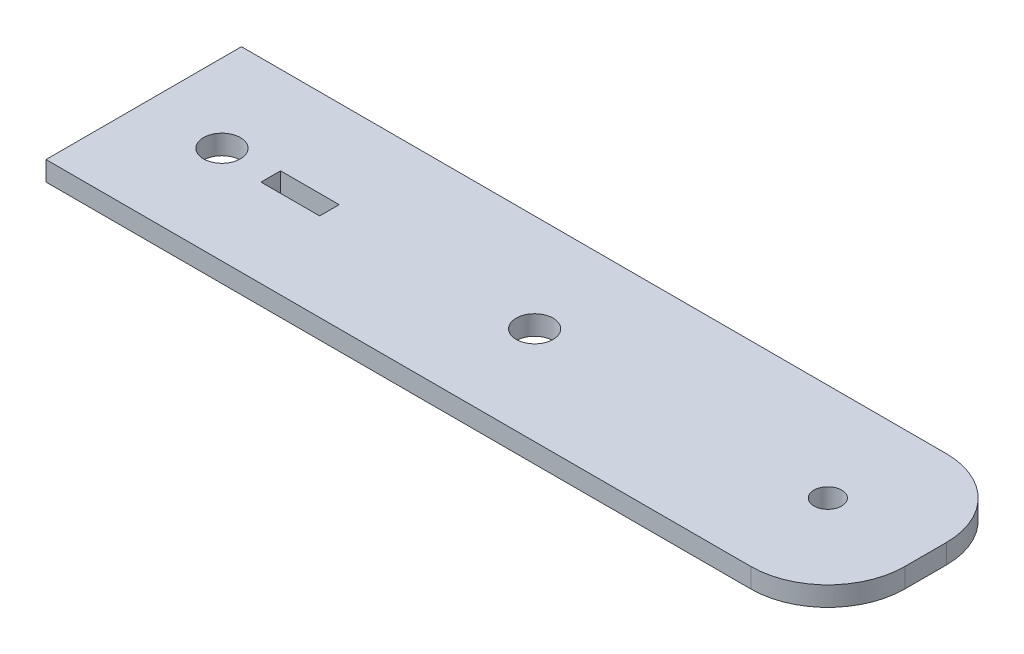
ISO-10303-21;
HEADER;
FILE_DESCRIPTION(('STEP AP214'),'2;1');
FILE_NAME('part.step','',(''),(''),'','','');
FILE_SCHEMA(('AUTOMOTIVE_DESIGN { 1 0 10303 214 1 1 1 1 }'));
ENDSEC;
DATA;
#1=APPLICATION_CONTEXT('core data for automotive mechanical design processes');
#2=APPLICATION_PROTOCOL_DEFINITION('international standard','automotive_design',2000,#1);
#3=PRODUCT_CONTEXT('',#1,'mechanical');
#4=PRODUCT('Part','Part','',(#3));
#5=PRODUCT_RELATED_PRODUCT_CATEGORY('part','',(#4));
#6=PRODUCT_DEFINITION_FORMATION('','',#4);
#7=PRODUCT_DEFINITION_CONTEXT('part definition',#1,'design');
#8=PRODUCT_DEFINITION('design','',#6,#7);
#9=PRODUCT_DEFINITION_SHAPE('','',#8);
#10=(LENGTH_UNIT() NAMED_UNIT(*) SI_UNIT(.MILLI.,.METRE.));
#11=(NAMED_UNIT(*) PLANE_ANGLE_UNIT() SI_UNIT($,.RADIAN.));
#12=(NAMED_UNIT(*) SI_UNIT($,.STERADIAN.) SOLID_ANGLE_UNIT());
#13=UNCERTAINTY_MEASURE_WITH_UNIT(LENGTH_MEASURE(1.E-05),#10,'distance_accuracy_value','');
#14=(GEOMETRIC_REPRESENTATION_CONTEXT(3) GLOBAL_UNCERTAINTY_ASSIGNED_CONTEXT((#13)) GLOBAL_UNIT_ASSIGNED_CONTEXT((#10,
#11,#12)) REPRESENTATION_CONTEXT('',''));
#15=CARTESIAN_POINT('',(0.,0.,0.));
#16=DIRECTION('',(0.,0.,1.));
#17=DIRECTION('',(1.,0.,0.));
#18=AXIS2_PLACEMENT_3D('',#15,#16,#17);
#19=CARTESIAN_POINT('',(101.8,3.175,-3.375));
#20=DIRECTION('',(0.,-1.,0.));
#21=DIRECTION('',(0.,0.,-1.));
#22=AXIS2_PLACEMENT_3D('',#19,#20,#21);
#23=PLANE('',#22);
#24=CARTESIAN_POINT('',(50.8,3.175,0.));
#25=DIRECTION('',(0.,1.,0.));
#26=DIRECTION('',(0.,0.,1.));
#27=AXIS2_PLACEMENT_3D('',#24,#25,#26);
#28=CIRCLE('',#27,3.);
#29=CARTESIAN_POINT('',(50.8,3.175,3.));
#30=VERTEX_POINT('',#29);
#31=EDGE_CURVE('E152',#30,#30,#28,.T.);
#32=ORIENTED_EDGE('',*,*,#31,.F.);
#33=EDGE_LOOP('',(#32));
#34=FACE_BOUND('',#33,.T.);
#35=CARTESIAN_POINT('',(98.425,3.175,0.));
#36=DIRECTION('',(0.,1.,0.));
#37=DIRECTION('',(0.,0.,1.));
#38=AXIS2_PLACEMENT_3D('',#35,#36,#37);
#39=CIRCLE('',#38,2.25);
#40=CARTESIAN_POINT('',(98.425,3.175,2.25));
#41=VERTEX_POINT('',#40);
#42=EDGE_CURVE('E158',#41,#41,#39,.T.);
#43=ORIENTED_EDGE('',*,*,#42,.F.);
#44=EDGE_LOOP('',(#43));
#45=FACE_BOUND('',#44,.T.);
#46=CARTESIAN_POINT('',(0.,3.175,0.));
#47=DIRECTION('',(0.,1.,0.));
#48=DIRECTION('',(0.,0.,1.));
#49=AXIS2_PLACEMENT_3D('',#46,#47,#48);
#50=CIRCLE('',#49,3.);
#51=CARTESIAN_POINT('',(0.,3.175,3.));
#52=VERTEX_POINT('',#51);
#53=EDGE_CURVE('E164',#52,#52,#50,.T.);
#54=ORIENTED_EDGE('',*,*,#53,.F.);
#55=EDGE_LOOP('',(#54));
#56=FACE_BOUND('',#55,.T.);
#57=DIRECTION('',(0.,0.,1.));
#58=VECTOR('',#57,1.);
#59=CARTESIAN_POINT('',(-12.7,3.175,15.875));
#60=LINE('',#59,#58);
#61=CARTESIAN_POINT('',(-12.7,3.175,-15.875));
#62=VERTEX_POINT('',#61);
#63=CARTESIAN_POINT('',(-12.7,3.175,15.875));
#64=VERTEX_POINT('',#63);
#65=EDGE_CURVE('E170',#62,#64,#60,.T.);
#66=ORIENTED_EDGE('',*,*,#65,.T.);
#67=DIRECTION('',(1.,0.,0.));
#68=VECTOR('',#67,1.);
#69=CARTESIAN_POINT('',(-12.7,3.175,15.875));
#70=LINE('',#69,#68);
#71=CARTESIAN_POINT('',(101.8,3.175,15.875));
#72=VERTEX_POINT('',#71);
#73=EDGE_CURVE('E173',#64,#72,#70,.T.);
#74=ORIENTED_EDGE('',*,*,#73,.T.);
#75=CARTESIAN_POINT('',(101.8,3.175,3.375));
#76=DIRECTION('',(0.,1.,0.));
#77=DIRECTION('',(0.,0.,1.));
#78=AXIS2_PLACEMENT_3D('',#75,#76,#77);
#79=CIRCLE('',#78,12.5);
#80=CARTESIAN_POINT('',(114.3,3.175,3.37499999999991));
#81=VERTEX_POINT('',#80);
#82=EDGE_CURVE('E176',#72,#81,#79,.T.);
#83=ORIENTED_EDGE('',*,*,#82,.T.);
#84=DIRECTION('',(0.,0.,-1.));
#85=VECTOR('',#84,1.);
#86=CARTESIAN_POINT('',(114.3,3.175,3.37499999999991));
#87=LINE('',#86,#85);
#88=CARTESIAN_POINT('',(114.3,3.175,-3.37499999999991));
#89=VERTEX_POINT('',#88);
#90=EDGE_CURVE('E178',#81,#89,#87,.T.);
#91=ORIENTED_EDGE('',*,*,#90,.T.);
#92=CARTESIAN_POINT('',(101.8,3.175,-3.375));
#93=DIRECTION('',(0.,1.,0.));
#94=DIRECTION('',(0.,0.,-1.));
#95=AXIS2_PLACEMENT_3D('',#92,#93,#94);
#96=CIRCLE('',#95,12.5);
#97=CARTESIAN_POINT('',(101.8,3.175,-15.875));
#98=VERTEX_POINT('',#97);
#99=EDGE_CURVE('E180',#89,#98,#96,.T.);
#100=ORIENTED_EDGE('',*,*,#99,.T.);
#101=DIRECTION('',(-1.,0.,0.));
#102=VECTOR('',#101,1.);
#103=CARTESIAN_POINT('',(-12.7,3.175,-15.875));
#104=LINE('',#103,#102);
#105=EDGE_CURVE('E182',#98,#62,#104,.T.);
#106=ORIENTED_EDGE('',*,*,#105,.T.);
#107=EDGE_LOOP('',(#66,#74,#83,#91,#100,#106));
#108=FACE_BOUND('',#107,.T.);
#109=DIRECTION('',(0.,0.,-1.));
#110=VECTOR('',#109,1.);
#111=CARTESIAN_POINT('',(17.4625,3.175,1.5875));
#112=LINE('',#111,#110);
#113=CARTESIAN_POINT('',(17.4625,3.175,1.5875));
#114=VERTEX_POINT('',#113);
#115=CARTESIAN_POINT('',(17.4625,3.175,-1.5875));
#116=VERTEX_POINT('',#115);
#117=EDGE_CURVE('E116',#114,#116,#112,.T.);
#118=ORIENTED_EDGE('',*,*,#117,.F.);
#119=DIRECTION('',(1.,0.,0.));
#120=VECTOR('',#119,1.);
#121=CARTESIAN_POINT('',(7.9375,3.175,1.5875));
#122=LINE('',#121,#120);
#123=CARTESIAN_POINT('',(7.9375,3.175,1.5875));
#124=VERTEX_POINT('',#123);
#125=EDGE_CURVE('E138',#124,#114,#122,.T.);
#126=ORIENTED_EDGE('',*,*,#125,.F.);
#127=DIRECTION('',(0.,0.,1.));
#128=VECTOR('',#127,1.);
#129=CARTESIAN_POINT('',(7.9375,3.175,1.5875));
#130=LINE('',#129,#128);
#131=CARTESIAN_POINT('',(7.9375,3.175,-1.5875));
#132=VERTEX_POINT('',#131);
#133=EDGE_CURVE('E136',#132,#124,#130,.T.);
#134=ORIENTED_EDGE('',*,*,#133,.F.);
#135=DIRECTION('',(-1.,0.,0.));
#136=VECTOR('',#135,1.);
#137=CARTESIAN_POINT('',(7.9375,3.175,-1.5875));
#138=LINE('',#137,#136);
#139=EDGE_CURVE('E124',#116,#132,#138,.T.);
#140=ORIENTED_EDGE('',*,*,#139,.F.);
#141=EDGE_LOOP('',(#118,#126,#134,#140));
#142=FACE_BOUND('',#141,.T.);
#143=ADVANCED_FACE('F39',(#34,#45,#56,#108,#142),#23,.F.);
#144=CARTESIAN_POINT('',(101.8,0.,-3.375));
#145=DIRECTION('',(0.,-1.,0.));
#146=DIRECTION('',(0.,0.,-1.));
#147=AXIS2_PLACEMENT_3D('',#144,#145,#146);
#148=PLANE('',#147);
#149=CARTESIAN_POINT('',(98.425,0.,0.));
#150=DIRECTION('',(0.,1.,0.));
#151=DIRECTION('',(0.,0.,1.));
#152=AXIS2_PLACEMENT_3D('',#149,#150,#151);
#153=CIRCLE('',#152,2.25);
#154=CARTESIAN_POINT('',(98.425,0.,2.25));
#155=VERTEX_POINT('',#154);
#156=EDGE_CURVE('E155',#155,#155,#153,.T.);
#157=ORIENTED_EDGE('',*,*,#156,.T.);
#158=EDGE_LOOP('',(#157));
#159=FACE_BOUND('',#158,.T.);
#160=DIRECTION('',(0.,0.,1.));
#161=VECTOR('',#160,1.);
#162=CARTESIAN_POINT('',(-12.7,0.,15.875));
#163=LINE('',#162,#161);
#164=CARTESIAN_POINT('',(-12.7,0.,-15.875));
#165=VERTEX_POINT('',#164);
#166=CARTESIAN_POINT('',(-12.7,0.,15.875));
#167=VERTEX_POINT('',#166);
#168=EDGE_CURVE('E167',#165,#167,#163,.T.);
#169=ORIENTED_EDGE('',*,*,#168,.F.);
#170=DIRECTION('',(-1.,0.,0.));
#171=VECTOR('',#170,1.);
#172=CARTESIAN_POINT('',(-12.7,0.,-15.875));
#173=LINE('',#172,#171);
#174=CARTESIAN_POINT('',(101.8,0.,-15.875));
#175=VERTEX_POINT('',#174);
#176=EDGE_CURVE('E174',#175,#165,#173,.T.);
#177=ORIENTED_EDGE('',*,*,#176,.F.);
#178=CARTESIAN_POINT('',(101.8,0.,-3.375));
#179=DIRECTION('',(0.,1.,0.));
#180=DIRECTION('',(0.,0.,-1.));
#181=AXIS2_PLACEMENT_3D('',#178,#179,#180);
#182=CIRCLE('',#181,12.5);
#183=CARTESIAN_POINT('',(114.3,0.,-3.37499999999991));
#184=VERTEX_POINT('',#183);
#185=EDGE_CURVE('E193',#184,#175,#182,.T.);
#186=ORIENTED_EDGE('',*,*,#185,.F.);
#187=DIRECTION('',(0.,0.,-1.));
#188=VECTOR('',#187,1.);
#189=CARTESIAN_POINT('',(114.3,0.,3.37499999999991));
#190=LINE('',#189,#188);
#191=CARTESIAN_POINT('',(114.3,0.,3.37499999999991));
#192=VERTEX_POINT('',#191);
#193=EDGE_CURVE('E191',#192,#184,#190,.T.);
#194=ORIENTED_EDGE('',*,*,#193,.F.);
#195=CARTESIAN_POINT('',(101.8,0.,3.375));
#196=DIRECTION('',(0.,1.,0.));
#197=DIRECTION('',(0.,0.,1.));
#198=AXIS2_PLACEMENT_3D('',#195,#196,#197);
#199=CIRCLE('',#198,12.5);
#200=CARTESIAN_POINT('',(101.8,0.,15.875));
#201=VERTEX_POINT('',#200);
#202=EDGE_CURVE('E189',#201,#192,#199,.T.);
#203=ORIENTED_EDGE('',*,*,#202,.F.);
#204=DIRECTION('',(1.,0.,0.));
#205=VECTOR('',#204,1.);
#206=CARTESIAN_POINT('',(-12.7,0.,15.875));
#207=LINE('',#206,#205);
#208=EDGE_CURVE('E187',#167,#201,#207,.T.);
#209=ORIENTED_EDGE('',*,*,#208,.F.);
#210=EDGE_LOOP('',(#169,#177,#186,#194,#203,#209));
#211=FACE_BOUND('',#210,.T.);
#212=CARTESIAN_POINT('',(0.,0.,0.));
#213=DIRECTION('',(0.,1.,0.));
#214=DIRECTION('',(0.,0.,1.));
#215=AXIS2_PLACEMENT_3D('',#212,#213,#214);
#216=CIRCLE('',#215,3.);
#217=CARTESIAN_POINT('',(0.,0.,3.));
#218=VERTEX_POINT('',#217);
#219=EDGE_CURVE('E161',#218,#218,#216,.T.);
#220=ORIENTED_EDGE('',*,*,#219,.T.);
#221=EDGE_LOOP('',(#220));
#222=FACE_BOUND('',#221,.T.);
#223=CARTESIAN_POINT('',(50.8,0.,0.));
#224=DIRECTION('',(0.,1.,0.));
#225=DIRECTION('',(0.,0.,1.));
#226=AXIS2_PLACEMENT_3D('',#223,#224,#225);
#227=CIRCLE('',#226,3.);
#228=CARTESIAN_POINT('',(50.8,0.,3.));
#229=VERTEX_POINT('',#228);
#230=EDGE_CURVE('E132',#229,#229,#227,.T.);
#231=ORIENTED_EDGE('',*,*,#230,.T.);
#232=EDGE_LOOP('',(#231));
#233=FACE_BOUND('',#232,.T.);
#234=DIRECTION('',(1.,0.,0.));
#235=VECTOR('',#234,1.);
#236=CARTESIAN_POINT('',(7.9375,0.,1.5875));
#237=LINE('',#236,#235);
#238=CARTESIAN_POINT('',(7.9375,0.,1.5875));
#239=VERTEX_POINT('',#238);
#240=CARTESIAN_POINT('',(17.4625,0.,1.5875));
#241=VERTEX_POINT('',#240);
#242=EDGE_CURVE('E125',#239,#241,#237,.T.);
#243=ORIENTED_EDGE('',*,*,#242,.T.);
#244=DIRECTION('',(0.,0.,-1.));
#245=VECTOR('',#244,1.);
#246=CARTESIAN_POINT('',(17.4625,0.,1.5875));
#247=LINE('',#246,#245);
#248=CARTESIAN_POINT('',(17.4625,0.,-1.5875));
#249=VERTEX_POINT('',#248);
#250=EDGE_CURVE('E62',#241,#249,#247,.T.);
#251=ORIENTED_EDGE('',*,*,#250,.T.);
#252=DIRECTION('',(-1.,0.,0.));
#253=VECTOR('',#252,1.);
#254=CARTESIAN_POINT('',(7.9375,0.,-1.5875));
#255=LINE('',#254,#253);
#256=CARTESIAN_POINT('',(7.9375,0.,-1.5875));
#257=VERTEX_POINT('',#256);
#258=EDGE_CURVE('E131',#249,#257,#255,.T.);
#259=ORIENTED_EDGE('',*,*,#258,.T.);
#260=DIRECTION('',(0.,0.,1.));
#261=VECTOR('',#260,1.);
#262=CARTESIAN_POINT('',(7.9375,0.,1.5875));
#263=LINE('',#262,#261);
#264=EDGE_CURVE('E144',#257,#239,#263,.T.);
#265=ORIENTED_EDGE('',*,*,#264,.T.);
#266=EDGE_LOOP('',(#243,#251,#259,#265));
#267=FACE_BOUND('',#266,.T.);
#268=ADVANCED_FACE('F217',(#159,#211,#222,#233,#267),#148,.T.);
#269=CARTESIAN_POINT('',(-12.7,3.175,15.875));
#270=DIRECTION('',(1.,0.,0.));
#271=DIRECTION('',(0.,0.,-1.));
#272=AXIS2_PLACEMENT_3D('',#269,#270,#271);
#273=PLANE('',#272);
#274=ORIENTED_EDGE('',*,*,#168,.T.);
#275=DIRECTION('',(0.,-1.,0.));
#276=VECTOR('',#275,1.);
#277=CARTESIAN_POINT('',(-12.7,3.175,15.875));
#278=LINE('',#277,#276);
#279=EDGE_CURVE('E11',#64,#167,#278,.T.);
#280=ORIENTED_EDGE('',*,*,#279,.F.);
#281=ORIENTED_EDGE('',*,*,#65,.F.);
#282=DIRECTION('',(0.,-1.,0.));
#283=VECTOR('',#282,1.);
#284=CARTESIAN_POINT('',(-12.7,3.175,-15.875));
#285=LINE('',#284,#283);
#286=EDGE_CURVE('E184',#62,#165,#285,.T.);
#287=ORIENTED_EDGE('',*,*,#286,.T.);
#288=EDGE_LOOP('',(#274,#280,#281,#287));
#289=FACE_BOUND('',#288,.T.);
#290=ADVANCED_FACE('F41',(#289),#273,.F.);
#291=CARTESIAN_POINT('',(-12.7,3.175,15.875));
#292=DIRECTION('',(0.,0.,-1.));
#293=DIRECTION('',(-1.,0.,0.));
#294=AXIS2_PLACEMENT_3D('',#291,#292,#293);
#295=PLANE('',#294);
#296=ORIENTED_EDGE('',*,*,#208,.T.);
#297=DIRECTION('',(0.,-1.,0.));
#298=VECTOR('',#297,1.);
#299=CARTESIAN_POINT('',(101.8,3.175,15.875));
#300=LINE('',#299,#298);
#301=EDGE_CURVE('E47',#72,#201,#300,.T.);
#302=ORIENTED_EDGE('',*,*,#301,.F.);
#303=ORIENTED_EDGE('',*,*,#73,.F.);
#304=ORIENTED_EDGE('',*,*,#279,.T.);
#305=EDGE_LOOP('',(#296,#302,#303,#304));
#306=FACE_BOUND('',#305,.T.);
#307=ADVANCED_FACE('F234',(#306),#295,.F.);
#308=CARTESIAN_POINT('',(101.8,3.175,3.375));
#309=DIRECTION('',(0.,-1.,0.));
#310=DIRECTION('',(0.,0.,-1.));
#311=AXIS2_PLACEMENT_3D('',#308,#309,#310);
#312=CYLINDRICAL_SURFACE('',#311,12.5);
#313=ORIENTED_EDGE('',*,*,#202,.T.);
#314=DIRECTION('',(0.,-1.,0.));
#315=VECTOR('',#314,1.);
#316=CARTESIAN_POINT('',(114.3,3.175,3.37499999999991));
#317=LINE('',#316,#315);
#318=EDGE_CURVE('E204',#81,#192,#317,.T.);
#319=ORIENTED_EDGE('',*,*,#318,.F.);
#320=ORIENTED_EDGE('',*,*,#82,.F.);
#321=ORIENTED_EDGE('',*,*,#301,.T.);
#322=EDGE_LOOP('',(#313,#319,#320,#321));
#323=FACE_BOUND('',#322,.T.);
#324=ADVANCED_FACE('F211',(#323),#312,.T.);
#325=CARTESIAN_POINT('',(114.3,3.175,3.37499999999991));
#326=DIRECTION('',(-1.,0.,0.));
#327=DIRECTION('',(0.,0.,1.));
#328=AXIS2_PLACEMENT_3D('',#325,#326,#327);
#329=PLANE('',#328);
#330=ORIENTED_EDGE('',*,*,#193,.T.);
#331=DIRECTION('',(0.,-1.,0.));
#332=VECTOR('',#331,1.);
#333=CARTESIAN_POINT('',(114.3,3.175,-3.37499999999991));
#334=LINE('',#333,#332);
#335=EDGE_CURVE('E201',#89,#184,#334,.T.);
#336=ORIENTED_EDGE('',*,*,#335,.F.);
#337=ORIENTED_EDGE('',*,*,#90,.F.);
#338=ORIENTED_EDGE('',*,*,#318,.T.);
#339=EDGE_LOOP('',(#330,#336,#337,#338));
#340=FACE_BOUND('',#339,.T.);
#341=ADVANCED_FACE('F223',(#340),#329,.F.);
#342=CARTESIAN_POINT('',(101.8,3.175,-3.375));
#343=DIRECTION('',(0.,-1.,0.));
#344=DIRECTION('',(0.,0.,-1.));
#345=AXIS2_PLACEMENT_3D('',#342,#343,#344);
#346=CYLINDRICAL_SURFACE('',#345,12.5);
#347=ORIENTED_EDGE('',*,*,#185,.T.);
#348=DIRECTION('',(0.,-1.,0.));
#349=VECTOR('',#348,1.);
#350=CARTESIAN_POINT('',(101.8,3.175,-15.875));
#351=LINE('',#350,#349);
#352=EDGE_CURVE('E198',#98,#175,#351,.T.);
#353=ORIENTED_EDGE('',*,*,#352,.F.);
#354=ORIENTED_EDGE('',*,*,#99,.F.);
#355=ORIENTED_EDGE('',*,*,#335,.T.);
#356=EDGE_LOOP('',(#347,#353,#354,#355));
#357=FACE_BOUND('',#356,.T.);
#358=ADVANCED_FACE('F227',(#357),#346,.T.);
#359=CARTESIAN_POINT('',(-12.7,3.175,-15.875));
#360=DIRECTION('',(0.,0.,1.));
#361=DIRECTION('',(1.,0.,0.));
#362=AXIS2_PLACEMENT_3D('',#359,#360,#361);
#363=PLANE('',#362);
#364=ORIENTED_EDGE('',*,*,#176,.T.);
#365=ORIENTED_EDGE('',*,*,#286,.F.);
#366=ORIENTED_EDGE('',*,*,#105,.F.);
#367=ORIENTED_EDGE('',*,*,#352,.T.);
#368=EDGE_LOOP('',(#364,#365,#366,#367));
#369=FACE_BOUND('',#368,.T.);
#370=ADVANCED_FACE('F237',(#369),#363,.F.);
#371=CARTESIAN_POINT('',(0.,3.175,0.));
#372=DIRECTION('',(0.,-1.,0.));
#373=DIRECTION('',(0.,0.,-1.));
#374=AXIS2_PLACEMENT_3D('',#371,#372,#373);
#375=CYLINDRICAL_SURFACE('',#374,3.);
#376=ORIENTED_EDGE('',*,*,#53,.T.);
#377=EDGE_LOOP('',(#376));
#378=FACE_BOUND('',#377,.T.);
#379=ORIENTED_EDGE('',*,*,#219,.F.);
#380=EDGE_LOOP('',(#379));
#381=FACE_BOUND('',#380,.T.);
#382=ADVANCED_FACE('F239',(#378,#381),#375,.F.);
#383=CARTESIAN_POINT('',(98.425,3.175,0.));
#384=DIRECTION('',(0.,-1.,0.));
#385=DIRECTION('',(0.,0.,-1.));
#386=AXIS2_PLACEMENT_3D('',#383,#384,#385);
#387=CYLINDRICAL_SURFACE('',#386,2.25);
#388=ORIENTED_EDGE('',*,*,#42,.T.);
#389=EDGE_LOOP('',(#388));
#390=FACE_BOUND('',#389,.T.);
#391=ORIENTED_EDGE('',*,*,#156,.F.);
#392=EDGE_LOOP('',(#391));
#393=FACE_BOUND('',#392,.T.);
#394=ADVANCED_FACE('F245',(#390,#393),#387,.F.);
#395=CARTESIAN_POINT('',(50.8,3.175,0.));
#396=DIRECTION('',(0.,-1.,0.));
#397=DIRECTION('',(0.,0.,-1.));
#398=AXIS2_PLACEMENT_3D('',#395,#396,#397);
#399=CYLINDRICAL_SURFACE('',#398,3.);
#400=ORIENTED_EDGE('',*,*,#31,.T.);
#401=EDGE_LOOP('',(#400));
#402=FACE_BOUND('',#401,.T.);
#403=ORIENTED_EDGE('',*,*,#230,.F.);
#404=EDGE_LOOP('',(#403));
#405=FACE_BOUND('',#404,.T.);
#406=ADVANCED_FACE('F262',(#402,#405),#399,.F.);
#407=CARTESIAN_POINT('',(17.4625,3.175,1.5875));
#408=DIRECTION('',(-1.,0.,0.));
#409=DIRECTION('',(0.,0.,1.));
#410=AXIS2_PLACEMENT_3D('',#407,#408,#409);
#411=PLANE('',#410);
#412=ORIENTED_EDGE('',*,*,#250,.F.);
#413=DIRECTION('',(0.,-1.,0.));
#414=VECTOR('',#413,1.);
#415=CARTESIAN_POINT('',(17.4625,3.175,1.5875));
#416=LINE('',#415,#414);
#417=EDGE_CURVE('E120',#114,#241,#416,.T.);
#418=ORIENTED_EDGE('',*,*,#417,.F.);
#419=ORIENTED_EDGE('',*,*,#117,.T.);
#420=DIRECTION('',(0.,-1.,0.));
#421=VECTOR('',#420,1.);
#422=CARTESIAN_POINT('',(17.4625,3.175,-1.5875));
#423=LINE('',#422,#421);
#424=EDGE_CURVE('E119',#116,#249,#423,.T.);
#425=ORIENTED_EDGE('',*,*,#424,.T.);
#426=EDGE_LOOP('',(#412,#418,#419,#425));
#427=FACE_BOUND('',#426,.T.);
#428=ADVANCED_FACE('F118',(#427),#411,.T.);
#429=CARTESIAN_POINT('',(7.9375,3.175,-1.5875));
#430=DIRECTION('',(0.,0.,1.));
#431=DIRECTION('',(1.,0.,0.));
#432=AXIS2_PLACEMENT_3D('',#429,#430,#431);
#433=PLANE('',#432);
#434=ORIENTED_EDGE('',*,*,#258,.F.);
#435=ORIENTED_EDGE('',*,*,#424,.F.);
#436=ORIENTED_EDGE('',*,*,#139,.T.);
#437=DIRECTION('',(0.,-1.,0.));
#438=VECTOR('',#437,1.);
#439=CARTESIAN_POINT('',(7.9375,3.175,-1.5875));
#440=LINE('',#439,#438);
#441=EDGE_CURVE('E133',#132,#257,#440,.T.);
#442=ORIENTED_EDGE('',*,*,#441,.T.);
#443=EDGE_LOOP('',(#434,#435,#436,#442));
#444=FACE_BOUND('',#443,.T.);
#445=ADVANCED_FACE('F128',(#444),#433,.T.);
#446=CARTESIAN_POINT('',(7.9375,3.175,1.5875));
#447=DIRECTION('',(1.,0.,0.));
#448=DIRECTION('',(0.,0.,-1.));
#449=AXIS2_PLACEMENT_3D('',#446,#447,#448);
#450=PLANE('',#449);
#451=ORIENTED_EDGE('',*,*,#264,.F.);
#452=ORIENTED_EDGE('',*,*,#441,.F.);
#453=ORIENTED_EDGE('',*,*,#133,.T.);
#454=DIRECTION('',(0.,-1.,0.));
#455=VECTOR('',#454,1.);
#456=CARTESIAN_POINT('',(7.9375,3.175,1.5875));
#457=LINE('',#456,#455);
#458=EDGE_CURVE('E54',#124,#239,#457,.T.);
#459=ORIENTED_EDGE('',*,*,#458,.T.);
#460=EDGE_LOOP('',(#451,#452,#453,#459));
#461=FACE_BOUND('',#460,.T.);
#462=ADVANCED_FACE('F271',(#461),#450,.T.);
#463=CARTESIAN_POINT('',(7.9375,3.175,1.5875));
#464=DIRECTION('',(0.,0.,-1.));
#465=DIRECTION('',(-1.,0.,0.));
#466=AXIS2_PLACEMENT_3D('',#463,#464,#465);
#467=PLANE('',#466);
#468=ORIENTED_EDGE('',*,*,#242,.F.);
#469=ORIENTED_EDGE('',*,*,#458,.F.);
#470=ORIENTED_EDGE('',*,*,#125,.T.);
#471=ORIENTED_EDGE('',*,*,#417,.T.);
#472=EDGE_LOOP('',(#468,#469,#470,#471));
#473=FACE_BOUND('',#472,.T.);
#474=ADVANCED_FACE('F274',(#473),#467,.T.);
#475=CLOSED_SHELL('',(#143,#268,#290,#307,#324,#341,#358,#370,#382,#394,#406,#428,#445,#462,#474));
#476=MANIFOLD_SOLID_BREP('B2',#475);
#477=ADVANCED_BREP_SHAPE_REPRESENTATION('',(#18,#476),#14);
#478=SHAPE_DEFINITION_REPRESENTATION(#9,#477);
ENDSEC;
END-ISO-10303-21;
